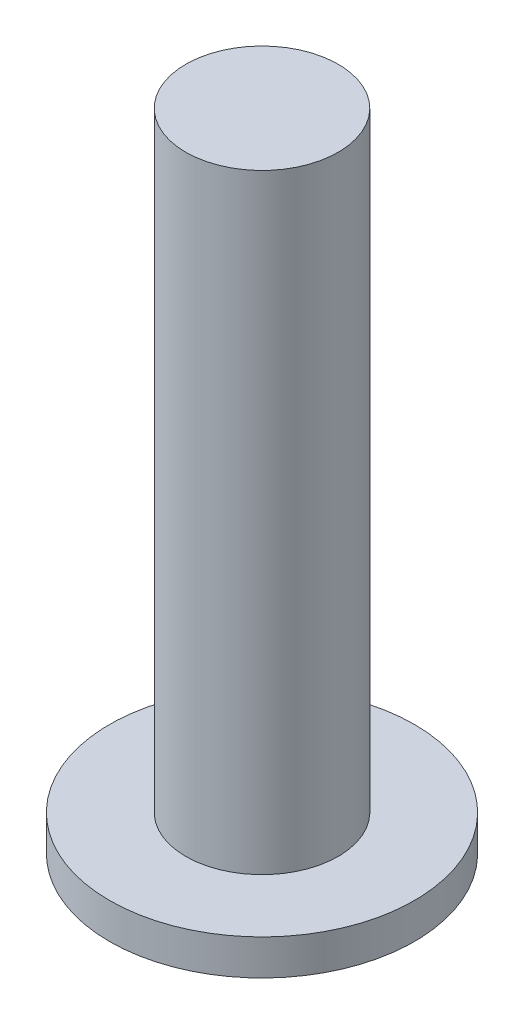
ISO-10303-21;
HEADER;
FILE_DESCRIPTION(('STEP AP214'),'2;1');
FILE_NAME('part.step','',(''),(''),'','','');
FILE_SCHEMA(('AUTOMOTIVE_DESIGN { 1 0 10303 214 1 1 1 1 }'));
ENDSEC;
DATA;
#1=APPLICATION_CONTEXT('core data for automotive mechanical design processes');
#2=APPLICATION_PROTOCOL_DEFINITION('international standard','automotive_design',2000,#1);
#3=PRODUCT_CONTEXT('',#1,'mechanical');
#4=PRODUCT('Part','Part','',(#3));
#5=PRODUCT_RELATED_PRODUCT_CATEGORY('part','',(#4));
#6=PRODUCT_DEFINITION_FORMATION('','',#4);
#7=PRODUCT_DEFINITION_CONTEXT('part definition',#1,'design');
#8=PRODUCT_DEFINITION('design','',#6,#7);
#9=PRODUCT_DEFINITION_SHAPE('','',#8);
#10=(LENGTH_UNIT() NAMED_UNIT(*) SI_UNIT(.MILLI.,.METRE.));
#11=(NAMED_UNIT(*) PLANE_ANGLE_UNIT() SI_UNIT($,.RADIAN.));
#12=(NAMED_UNIT(*) SI_UNIT($,.STERADIAN.) SOLID_ANGLE_UNIT());
#13=UNCERTAINTY_MEASURE_WITH_UNIT(LENGTH_MEASURE(1.E-05),#10,'distance_accuracy_value','');
#14=(GEOMETRIC_REPRESENTATION_CONTEXT(3) GLOBAL_UNCERTAINTY_ASSIGNED_CONTEXT((#13)) GLOBAL_UNIT_ASSIGNED_CONTEXT((#10,
#11,#12)) REPRESENTATION_CONTEXT('',''));
#15=CARTESIAN_POINT('',(0.,0.,0.));
#16=DIRECTION('',(0.,0.,1.));
#17=DIRECTION('',(1.,0.,0.));
#18=AXIS2_PLACEMENT_3D('',#15,#16,#17);
#19=CARTESIAN_POINT('',(0.,0.35,0.));
#20=DIRECTION('',(0.,-1.,0.));
#21=DIRECTION('',(0.,0.,-1.));
#22=AXIS2_PLACEMENT_3D('',#19,#20,#21);
#23=CYLINDRICAL_SURFACE('',#22,1.5);
#24=CARTESIAN_POINT('',(0.,0.35,0.));
#25=DIRECTION('',(0.,1.,0.));
#26=DIRECTION('',(0.,0.,1.));
#27=AXIS2_PLACEMENT_3D('',#24,#25,#26);
#28=CIRCLE('',#27,1.5);
#29=CARTESIAN_POINT('',(0.,0.35,1.5));
#30=VERTEX_POINT('',#29);
#31=EDGE_CURVE('E49',#30,#30,#28,.T.);
#32=ORIENTED_EDGE('',*,*,#31,.F.);
#33=EDGE_LOOP('',(#32));
#34=FACE_BOUND('',#33,.T.);
#35=CARTESIAN_POINT('',(0.,0.,0.));
#36=DIRECTION('',(0.,1.,0.));
#37=DIRECTION('',(0.,0.,1.));
#38=AXIS2_PLACEMENT_3D('',#35,#36,#37);
#39=CIRCLE('',#38,1.5);
#40=CARTESIAN_POINT('',(0.,0.,1.5));
#41=VERTEX_POINT('',#40);
#42=EDGE_CURVE('E44',#41,#41,#39,.T.);
#43=ORIENTED_EDGE('',*,*,#42,.T.);
#44=EDGE_LOOP('',(#43));
#45=FACE_BOUND('',#44,.T.);
#46=ADVANCED_FACE('F41',(#34,#45),#23,.T.);
#47=CARTESIAN_POINT('',(0.,0.35,0.));
#48=DIRECTION('',(0.,1.,0.));
#49=DIRECTION('',(0.,0.,1.));
#50=AXIS2_PLACEMENT_3D('',#47,#48,#49);
#51=PLANE('',#50);
#52=CARTESIAN_POINT('',(0.,0.35,0.));
#53=DIRECTION('',(0.,1.,0.));
#54=DIRECTION('',(0.,0.,1.));
#55=AXIS2_PLACEMENT_3D('',#52,#53,#54);
#56=CIRCLE('',#55,0.75);
#57=CARTESIAN_POINT('',(0.,0.35,0.75));
#58=VERTEX_POINT('',#57);
#59=EDGE_CURVE('E10',#58,#58,#56,.T.);
#60=ORIENTED_EDGE('',*,*,#59,.F.);
#61=EDGE_LOOP('',(#60));
#62=FACE_BOUND('',#61,.T.);
#63=ORIENTED_EDGE('',*,*,#31,.T.);
#64=EDGE_LOOP('',(#63));
#65=FACE_BOUND('',#64,.T.);
#66=ADVANCED_FACE('F69',(#62,#65),#51,.T.);
#67=CARTESIAN_POINT('',(0.,0.,0.));
#68=DIRECTION('',(0.,1.,0.));
#69=DIRECTION('',(0.,0.,1.));
#70=AXIS2_PLACEMENT_3D('',#67,#68,#69);
#71=PLANE('',#70);
#72=ORIENTED_EDGE('',*,*,#42,.F.);
#73=EDGE_LOOP('',(#72));
#74=FACE_BOUND('',#73,.T.);
#75=ADVANCED_FACE('F66',(#74),#71,.F.);
#76=CARTESIAN_POINT('',(0.,6.35,0.));
#77=DIRECTION('',(0.,-1.,0.));
#78=DIRECTION('',(0.,0.,-1.));
#79=AXIS2_PLACEMENT_3D('',#76,#77,#78);
#80=CYLINDRICAL_SURFACE('',#79,0.75);
#81=CARTESIAN_POINT('',(0.,6.35,0.));
#82=DIRECTION('',(0.,1.,0.));
#83=DIRECTION('',(0.,0.,1.));
#84=AXIS2_PLACEMENT_3D('',#81,#82,#83);
#85=CIRCLE('',#84,0.75);
#86=CARTESIAN_POINT('',(0.,6.35,0.75));
#87=VERTEX_POINT('',#86);
#88=EDGE_CURVE('E56',#87,#87,#85,.T.);
#89=ORIENTED_EDGE('',*,*,#88,.F.);
#90=EDGE_LOOP('',(#89));
#91=FACE_BOUND('',#90,.T.);
#92=ORIENTED_EDGE('',*,*,#59,.T.);
#93=EDGE_LOOP('',(#92));
#94=FACE_BOUND('',#93,.T.);
#95=ADVANCED_FACE('F68',(#91,#94),#80,.T.);
#96=CARTESIAN_POINT('',(0.,6.35,0.));
#97=DIRECTION('',(0.,1.,0.));
#98=DIRECTION('',(0.,0.,1.));
#99=AXIS2_PLACEMENT_3D('',#96,#97,#98);
#100=PLANE('',#99);
#101=ORIENTED_EDGE('',*,*,#88,.T.);
#102=EDGE_LOOP('',(#101));
#103=FACE_BOUND('',#102,.T.);
#104=ADVANCED_FACE('F74',(#103),#100,.T.);
#105=CLOSED_SHELL('',(#46,#66,#75,#95,#104));
#106=MANIFOLD_SOLID_BREP('B2',#105);
#107=ADVANCED_BREP_SHAPE_REPRESENTATION('',(#18,#106),#14);
#108=SHAPE_DEFINITION_REPRESENTATION(#9,#107);
ENDSEC;
END-ISO-10303-21;
